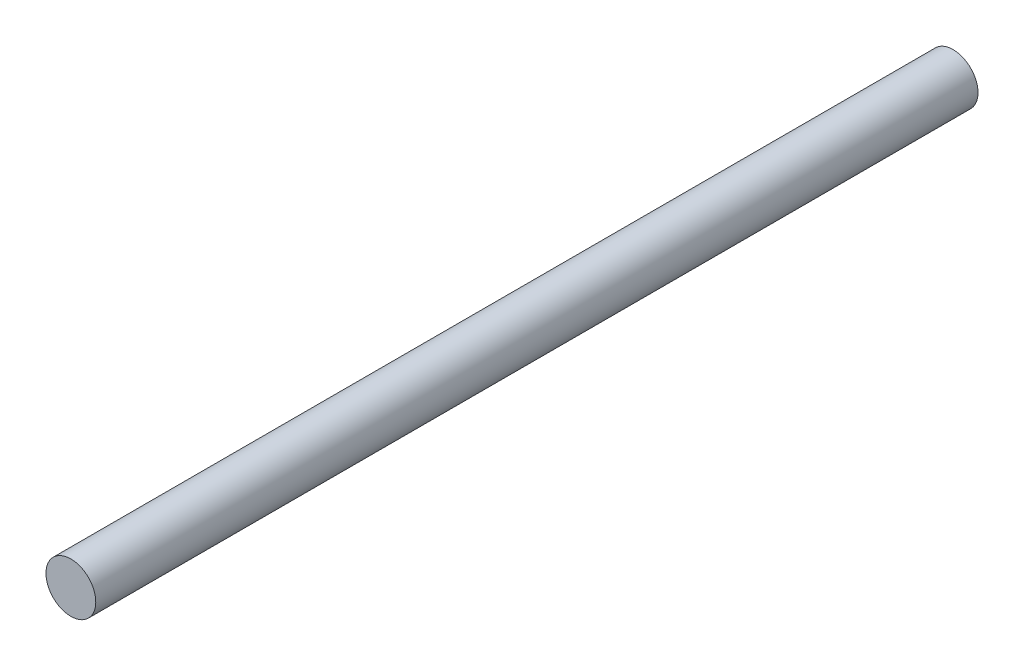
ISO-10303-21;
HEADER;
FILE_DESCRIPTION(('STEP AP214'),'2;1');
FILE_NAME('part.step','',(''),(''),'','','');
FILE_SCHEMA(('AUTOMOTIVE_DESIGN { 1 0 10303 214 1 1 1 1 }'));
ENDSEC;
DATA;
#1=APPLICATION_CONTEXT('core data for automotive mechanical design processes');
#2=APPLICATION_PROTOCOL_DEFINITION('international standard','automotive_design',2000,#1);
#3=PRODUCT_CONTEXT('',#1,'mechanical');
#4=PRODUCT('Part','Part','',(#3));
#5=PRODUCT_RELATED_PRODUCT_CATEGORY('part','',(#4));
#6=PRODUCT_DEFINITION_FORMATION('','',#4);
#7=PRODUCT_DEFINITION_CONTEXT('part definition',#1,'design');
#8=PRODUCT_DEFINITION('design','',#6,#7);
#9=PRODUCT_DEFINITION_SHAPE('','',#8);
#10=(LENGTH_UNIT() NAMED_UNIT(*) SI_UNIT(.MILLI.,.METRE.));
#11=(NAMED_UNIT(*) PLANE_ANGLE_UNIT() SI_UNIT($,.RADIAN.));
#12=(NAMED_UNIT(*) SI_UNIT($,.STERADIAN.) SOLID_ANGLE_UNIT());
#13=UNCERTAINTY_MEASURE_WITH_UNIT(LENGTH_MEASURE(1.E-05),#10,'distance_accuracy_value','');
#14=(GEOMETRIC_REPRESENTATION_CONTEXT(3) GLOBAL_UNCERTAINTY_ASSIGNED_CONTEXT((#13)) GLOBAL_UNIT_ASSIGNED_CONTEXT((#10,
#11,#12)) REPRESENTATION_CONTEXT('',''));
#15=CARTESIAN_POINT('',(0.,0.,0.));
#16=DIRECTION('',(0.,0.,1.));
#17=DIRECTION('',(1.,0.,0.));
#18=AXIS2_PLACEMENT_3D('',#15,#16,#17);
#19=CARTESIAN_POINT('',(0.,0.,65.535));
#20=DIRECTION('',(0.,0.,-1.));
#21=DIRECTION('',(-1.,0.,0.));
#22=AXIS2_PLACEMENT_3D('',#19,#20,#21);
#23=CYLINDRICAL_SURFACE('',#22,1.85);
#24=CARTESIAN_POINT('',(0.,0.,65.535));
#25=DIRECTION('',(0.,0.,1.));
#26=DIRECTION('',(1.,0.,0.));
#27=AXIS2_PLACEMENT_3D('',#24,#25,#26);
#28=CIRCLE('',#27,1.85);
#29=CARTESIAN_POINT('',(1.85,0.,65.535));
#30=VERTEX_POINT('',#29);
#31=EDGE_CURVE('E10',#30,#30,#28,.T.);
#32=ORIENTED_EDGE('',*,*,#31,.F.);
#33=EDGE_LOOP('',(#32));
#34=FACE_BOUND('',#33,.T.);
#35=CARTESIAN_POINT('',(0.,0.,0.));
#36=DIRECTION('',(0.,0.,1.));
#37=DIRECTION('',(1.,0.,0.));
#38=AXIS2_PLACEMENT_3D('',#35,#36,#37);
#39=CIRCLE('',#38,1.85);
#40=CARTESIAN_POINT('',(1.85,0.,0.));
#41=VERTEX_POINT('',#40);
#42=EDGE_CURVE('E37',#41,#41,#39,.T.);
#43=ORIENTED_EDGE('',*,*,#42,.T.);
#44=EDGE_LOOP('',(#43));
#45=FACE_BOUND('',#44,.T.);
#46=ADVANCED_FACE('F34',(#34,#45),#23,.T.);
#47=CARTESIAN_POINT('',(0.,0.,65.535));
#48=DIRECTION('',(0.,0.,1.));
#49=DIRECTION('',(1.,0.,0.));
#50=AXIS2_PLACEMENT_3D('',#47,#48,#49);
#51=PLANE('',#50);
#52=ORIENTED_EDGE('',*,*,#31,.T.);
#53=EDGE_LOOP('',(#52));
#54=FACE_BOUND('',#53,.T.);
#55=ADVANCED_FACE('F49',(#54),#51,.T.);
#56=CARTESIAN_POINT('',(0.,0.,0.));
#57=DIRECTION('',(0.,0.,1.));
#58=DIRECTION('',(1.,0.,0.));
#59=AXIS2_PLACEMENT_3D('',#56,#57,#58);
#60=PLANE('',#59);
#61=ORIENTED_EDGE('',*,*,#42,.F.);
#62=EDGE_LOOP('',(#61));
#63=FACE_BOUND('',#62,.T.);
#64=ADVANCED_FACE('F47',(#63),#60,.F.);
#65=CLOSED_SHELL('',(#46,#55,#64));
#66=MANIFOLD_SOLID_BREP('B2',#65);
#67=ADVANCED_BREP_SHAPE_REPRESENTATION('',(#18,#66),#14);
#68=SHAPE_DEFINITION_REPRESENTATION(#9,#67);
ENDSEC;
END-ISO-10303-21;
